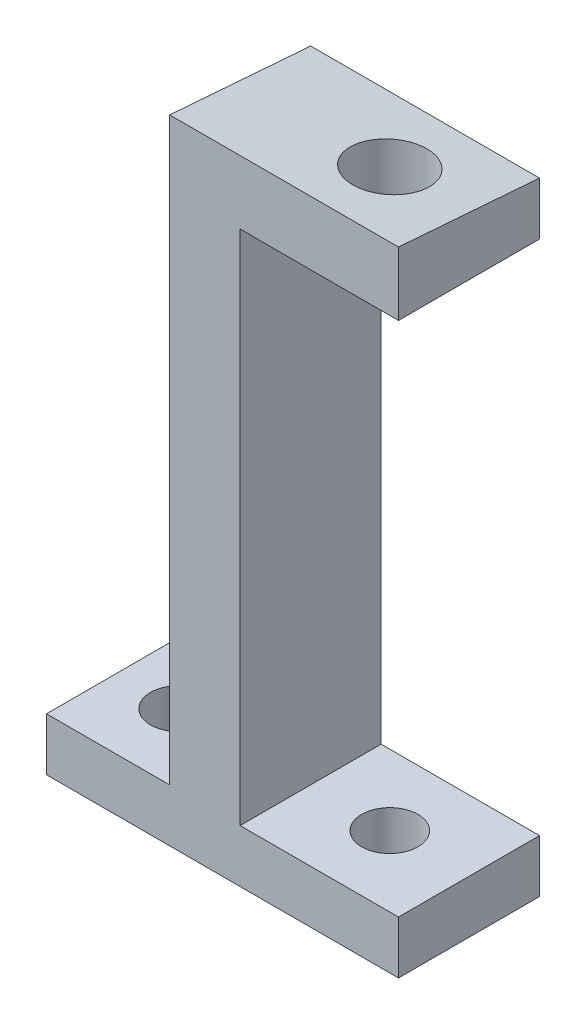
ISO-10303-21;
HEADER;
FILE_DESCRIPTION(('STEP AP214'),'2;1');
FILE_NAME('part.step','',(''),(''),'','','');
FILE_SCHEMA(('AUTOMOTIVE_DESIGN { 1 0 10303 214 1 1 1 1 }'));
ENDSEC;
DATA;
#1=APPLICATION_CONTEXT('core data for automotive mechanical design processes');
#2=APPLICATION_PROTOCOL_DEFINITION('international standard','automotive_design',2000,#1);
#3=PRODUCT_CONTEXT('',#1,'mechanical');
#4=PRODUCT('Part','Part','',(#3));
#5=PRODUCT_RELATED_PRODUCT_CATEGORY('part','',(#4));
#6=PRODUCT_DEFINITION_FORMATION('','',#4);
#7=PRODUCT_DEFINITION_CONTEXT('part definition',#1,'design');
#8=PRODUCT_DEFINITION('design','',#6,#7);
#9=PRODUCT_DEFINITION_SHAPE('','',#8);
#10=(LENGTH_UNIT() NAMED_UNIT(*) SI_UNIT(.MILLI.,.METRE.));
#11=(NAMED_UNIT(*) PLANE_ANGLE_UNIT() SI_UNIT($,.RADIAN.));
#12=(NAMED_UNIT(*) SI_UNIT($,.STERADIAN.) SOLID_ANGLE_UNIT());
#13=UNCERTAINTY_MEASURE_WITH_UNIT(LENGTH_MEASURE(1.E-05),#10,'distance_accuracy_value','');
#14=(GEOMETRIC_REPRESENTATION_CONTEXT(3) GLOBAL_UNCERTAINTY_ASSIGNED_CONTEXT((#13)) GLOBAL_UNIT_ASSIGNED_CONTEXT((#10,
#11,#12)) REPRESENTATION_CONTEXT('',''));
#15=CARTESIAN_POINT('',(0.,0.,0.));
#16=DIRECTION('',(0.,0.,1.));
#17=DIRECTION('',(1.,0.,0.));
#18=AXIS2_PLACEMENT_3D('',#15,#16,#17);
#19=CARTESIAN_POINT('',(-29.1166637722037,0.,-124.13391835524));
#20=DIRECTION('',(0.,0.,1.));
#21=DIRECTION('',(1.,0.,0.));
#22=AXIS2_PLACEMENT_3D('',#19,#20,#21);
#23=PLANE('',#22);
#24=DIRECTION('',(0.,-1.,0.));
#25=VECTOR('',#24,1.);
#26=CARTESIAN_POINT('',(-20.1166637722037,0.,-124.13391835524));
#27=LINE('',#26,#25);
#28=CARTESIAN_POINT('',(-20.1166637722038,76.6813694194692,-124.13391835524));
#29=VERTEX_POINT('',#28);
#30=CARTESIAN_POINT('',(-20.1166637722038,73.6813694194692,-124.13391835524));
#31=VERTEX_POINT('',#30);
#32=EDGE_CURVE('E190',#29,#31,#27,.T.);
#33=ORIENTED_EDGE('',*,*,#32,.T.);
#34=DIRECTION('',(1.,0.,0.));
#35=VECTOR('',#34,1.);
#36=CARTESIAN_POINT('',(-29.1166637722038,73.6813694194691,-124.13391835524));
#37=LINE('',#36,#35);
#38=CARTESIAN_POINT('',(-40.1166637722038,73.6813694194691,-124.13391835524));
#39=VERTEX_POINT('',#38);
#40=EDGE_CURVE('E12',#39,#31,#37,.T.);
#41=ORIENTED_EDGE('',*,*,#40,.F.);
#42=DIRECTION('',(0.,-1.,0.));
#43=VECTOR('',#42,1.);
#44=CARTESIAN_POINT('',(-40.1166637722037,0.,-124.13391835524));
#45=LINE('',#44,#43);
#46=CARTESIAN_POINT('',(-40.1166637722038,76.6813694194691,-124.13391835524));
#47=VERTEX_POINT('',#46);
#48=EDGE_CURVE('E256',#47,#39,#45,.T.);
#49=ORIENTED_EDGE('',*,*,#48,.F.);
#50=DIRECTION('',(1.,0.,0.));
#51=VECTOR('',#50,1.);
#52=CARTESIAN_POINT('',(-40.1166637722038,76.6813694194691,-124.13391835524));
#53=LINE('',#52,#51);
#54=CARTESIAN_POINT('',(-33.1166637722038,76.6813694194691,-124.13391835524));
#55=VERTEX_POINT('',#54);
#56=EDGE_CURVE('E248',#47,#55,#53,.T.);
#57=ORIENTED_EDGE('',*,*,#56,.T.);
#58=DIRECTION('',(0.,-1.,0.));
#59=VECTOR('',#58,1.);
#60=CARTESIAN_POINT('',(-33.1166637722037,0.,-124.13391835524));
#61=LINE('',#60,#59);
#62=CARTESIAN_POINT('',(-33.1166637722038,109.035971289038,-124.13391835524));
#63=VERTEX_POINT('',#62);
#64=EDGE_CURVE('E211',#63,#55,#61,.T.);
#65=ORIENTED_EDGE('',*,*,#64,.F.);
#66=DIRECTION('',(1.,0.,0.));
#67=VECTOR('',#66,1.);
#68=CARTESIAN_POINT('',(-33.1166637722038,109.035971289038,-124.13391835524));
#69=LINE('',#68,#67);
#70=CARTESIAN_POINT('',(-20.1166637722038,109.035971289038,-124.13391835524));
#71=VERTEX_POINT('',#70);
#72=EDGE_CURVE('E203',#63,#71,#69,.T.);
#73=ORIENTED_EDGE('',*,*,#72,.T.);
#74=DIRECTION('',(0.,-1.,0.));
#75=VECTOR('',#74,1.);
#76=CARTESIAN_POINT('',(-20.1166637722037,0.,-124.13391835524));
#77=LINE('',#76,#75);
#78=CARTESIAN_POINT('',(-20.1166637722038,106.035971289038,-124.13391835524));
#79=VERTEX_POINT('',#78);
#80=EDGE_CURVE('E237',#71,#79,#77,.T.);
#81=ORIENTED_EDGE('',*,*,#80,.T.);
#82=DIRECTION('',(1.,0.,0.));
#83=VECTOR('',#82,1.);
#84=CARTESIAN_POINT('',(-29.1166637722038,106.035971289038,-124.13391835524));
#85=LINE('',#84,#83);
#86=CARTESIAN_POINT('',(-29.1166637722038,106.035971289038,-124.13391835524));
#87=VERTEX_POINT('',#86);
#88=EDGE_CURVE('E223',#87,#79,#85,.T.);
#89=ORIENTED_EDGE('',*,*,#88,.F.);
#90=DIRECTION('',(0.,-1.,0.));
#91=VECTOR('',#90,1.);
#92=CARTESIAN_POINT('',(-29.1166637722037,0.,-124.13391835524));
#93=LINE('',#92,#91);
#94=CARTESIAN_POINT('',(-29.1166637722038,76.6813694194691,-124.13391835524));
#95=VERTEX_POINT('',#94);
#96=EDGE_CURVE('E220',#87,#95,#93,.T.);
#97=ORIENTED_EDGE('',*,*,#96,.T.);
#98=DIRECTION('',(1.,0.,0.));
#99=VECTOR('',#98,1.);
#100=CARTESIAN_POINT('',(-29.1166637722038,76.6813694194691,-124.13391835524));
#101=LINE('',#100,#99);
#102=EDGE_CURVE('E124',#95,#29,#101,.T.);
#103=ORIENTED_EDGE('',*,*,#102,.T.);
#104=EDGE_LOOP('',(#33,#41,#49,#57,#65,#73,#81,#89,#97,#103));
#105=FACE_BOUND('',#104,.T.);
#106=ADVANCED_FACE('F121',(#105),#23,.F.);
#107=CARTESIAN_POINT('',(-29.1166637722036,73.6813694194691,0.));
#108=DIRECTION('',(0.,1.,0.));
#109=DIRECTION('',(-1.,0.,0.));
#110=AXIS2_PLACEMENT_3D('',#107,#108,#109);
#111=PLANE('',#110);
#112=CARTESIAN_POINT('',(-24.6166637722038,73.6813694194691,-120.127472221893));
#113=DIRECTION('',(0.,1.,0.));
#114=DIRECTION('',(-1.,0.,0.));
#115=AXIS2_PLACEMENT_3D('',#112,#113,#114);
#116=CIRCLE('',#115,1.60000000000002);
#117=CARTESIAN_POINT('',(-26.2166637722038,73.6813694194691,-120.127472221893));
#118=VERTEX_POINT('',#117);
#119=EDGE_CURVE('E254',#118,#118,#116,.F.);
#120=ORIENTED_EDGE('',*,*,#119,.F.);
#121=EDGE_LOOP('',(#120));
#122=FACE_BOUND('',#121,.T.);
#123=CARTESIAN_POINT('',(-36.6166637722038,73.6813694194691,-120.127472221893));
#124=DIRECTION('',(0.,1.,0.));
#125=DIRECTION('',(-1.,0.,0.));
#126=AXIS2_PLACEMENT_3D('',#123,#124,#125);
#127=CIRCLE('',#126,1.60000000000034);
#128=CARTESIAN_POINT('',(-38.2166637722041,73.6813694194691,-120.127472221893));
#129=VERTEX_POINT('',#128);
#130=EDGE_CURVE('E266',#129,#129,#127,.F.);
#131=ORIENTED_EDGE('',*,*,#130,.F.);
#132=EDGE_LOOP('',(#131));
#133=FACE_BOUND('',#132,.T.);
#134=DIRECTION('',(0.,0.,1.));
#135=VECTOR('',#134,1.);
#136=CARTESIAN_POINT('',(-20.1166637722036,73.6813694194692,0.));
#137=LINE('',#136,#135);
#138=CARTESIAN_POINT('',(-20.1166637722037,73.6813694194692,-116.121026088545));
#139=VERTEX_POINT('',#138);
#140=EDGE_CURVE('E163',#31,#139,#137,.T.);
#141=ORIENTED_EDGE('',*,*,#140,.T.);
#142=DIRECTION('',(1.,0.,0.));
#143=VECTOR('',#142,1.);
#144=CARTESIAN_POINT('',(-29.1166637722037,73.6813694194691,-116.121026088545));
#145=LINE('',#144,#143);
#146=CARTESIAN_POINT('',(-40.1166637722038,73.6813694194691,-116.121026088545));
#147=VERTEX_POINT('',#146);
#148=EDGE_CURVE('E129',#147,#139,#145,.T.);
#149=ORIENTED_EDGE('',*,*,#148,.F.);
#150=DIRECTION('',(0.,0.,1.));
#151=VECTOR('',#150,1.);
#152=CARTESIAN_POINT('',(-40.1166637722036,73.6813694194691,0.));
#153=LINE('',#152,#151);
#154=EDGE_CURVE('E251',#39,#147,#153,.T.);
#155=ORIENTED_EDGE('',*,*,#154,.F.);
#156=ORIENTED_EDGE('',*,*,#40,.T.);
#157=EDGE_LOOP('',(#141,#149,#155,#156));
#158=FACE_BOUND('',#157,.T.);
#159=ADVANCED_FACE('F165',(#122,#133,#158),#111,.F.);
#160=CARTESIAN_POINT('',(-29.1166637722037,0.,-116.121026088545));
#161=DIRECTION('',(0.,0.,-1.));
#162=DIRECTION('',(-1.,0.,0.));
#163=AXIS2_PLACEMENT_3D('',#160,#161,#162);
#164=PLANE('',#163);
#165=DIRECTION('',(0.,1.,0.));
#166=VECTOR('',#165,1.);
#167=CARTESIAN_POINT('',(-20.1166637722037,0.,-116.121026088545));
#168=LINE('',#167,#166);
#169=CARTESIAN_POINT('',(-20.1166637722038,76.6813694194692,-116.121026088545));
#170=VERTEX_POINT('',#169);
#171=EDGE_CURVE('E175',#139,#170,#168,.T.);
#172=ORIENTED_EDGE('',*,*,#171,.T.);
#173=DIRECTION('',(1.,0.,0.));
#174=VECTOR('',#173,1.);
#175=CARTESIAN_POINT('',(-29.1166637722038,76.6813694194691,-116.121026088545));
#176=LINE('',#175,#174);
#177=CARTESIAN_POINT('',(-29.1166637722038,76.6813694194691,-116.121026088545));
#178=VERTEX_POINT('',#177);
#179=EDGE_CURVE('E184',#178,#170,#176,.T.);
#180=ORIENTED_EDGE('',*,*,#179,.F.);
#181=DIRECTION('',(0.,1.,0.));
#182=VECTOR('',#181,1.);
#183=CARTESIAN_POINT('',(-29.1166637722037,0.,-116.121026088545));
#184=LINE('',#183,#182);
#185=CARTESIAN_POINT('',(-29.1166637722038,106.035971289038,-116.121026088545));
#186=VERTEX_POINT('',#185);
#187=EDGE_CURVE('E146',#178,#186,#184,.T.);
#188=ORIENTED_EDGE('',*,*,#187,.T.);
#189=DIRECTION('',(1.,0.,0.));
#190=VECTOR('',#189,1.);
#191=CARTESIAN_POINT('',(-29.1166637722038,106.035971289038,-116.121026088545));
#192=LINE('',#191,#190);
#193=CARTESIAN_POINT('',(-20.1166637722038,106.035971289038,-116.121026088545));
#194=VERTEX_POINT('',#193);
#195=EDGE_CURVE('E229',#186,#194,#192,.T.);
#196=ORIENTED_EDGE('',*,*,#195,.T.);
#197=DIRECTION('',(0.,1.,0.));
#198=VECTOR('',#197,1.);
#199=CARTESIAN_POINT('',(-20.1166637722037,0.,-116.121026088545));
#200=LINE('',#199,#198);
#201=CARTESIAN_POINT('',(-20.1166637722038,109.651271916847,-116.121026088545));
#202=VERTEX_POINT('',#201);
#203=EDGE_CURVE('E242',#194,#202,#200,.T.);
#204=ORIENTED_EDGE('',*,*,#203,.T.);
#205=DIRECTION('',(1.,0.,0.));
#206=VECTOR('',#205,1.);
#207=CARTESIAN_POINT('',(-33.1166637722038,109.651271916847,-116.121026088545));
#208=LINE('',#207,#206);
#209=CARTESIAN_POINT('',(-33.1166637722038,109.651271916847,-116.121026088545));
#210=VERTEX_POINT('',#209);
#211=EDGE_CURVE('E200',#210,#202,#208,.T.);
#212=ORIENTED_EDGE('',*,*,#211,.F.);
#213=DIRECTION('',(0.,1.,0.));
#214=VECTOR('',#213,1.);
#215=CARTESIAN_POINT('',(-33.1166637722037,0.,-116.121026088545));
#216=LINE('',#215,#214);
#217=CARTESIAN_POINT('',(-33.1166637722038,76.6813694194691,-116.121026088545));
#218=VERTEX_POINT('',#217);
#219=EDGE_CURVE('E222',#218,#210,#216,.T.);
#220=ORIENTED_EDGE('',*,*,#219,.F.);
#221=DIRECTION('',(1.,0.,0.));
#222=VECTOR('',#221,1.);
#223=CARTESIAN_POINT('',(-40.1166637722038,76.6813694194691,-116.121026088545));
#224=LINE('',#223,#222);
#225=CARTESIAN_POINT('',(-40.1166637722038,76.6813694194691,-116.121026088545));
#226=VERTEX_POINT('',#225);
#227=EDGE_CURVE('E137',#226,#218,#224,.T.);
#228=ORIENTED_EDGE('',*,*,#227,.F.);
#229=DIRECTION('',(0.,1.,0.));
#230=VECTOR('',#229,1.);
#231=CARTESIAN_POINT('',(-40.1166637722037,0.,-116.121026088545));
#232=LINE('',#231,#230);
#233=EDGE_CURVE('E183',#147,#226,#232,.T.);
#234=ORIENTED_EDGE('',*,*,#233,.F.);
#235=ORIENTED_EDGE('',*,*,#148,.T.);
#236=EDGE_LOOP('',(#172,#180,#188,#196,#204,#212,#220,#228,#234,#235));
#237=FACE_BOUND('',#236,.T.);
#238=ADVANCED_FACE('F180',(#237),#164,.F.);
#239=CARTESIAN_POINT('',(-29.1166637722036,76.6813694194691,0.));
#240=DIRECTION('',(0.,1.,0.));
#241=DIRECTION('',(-1.,0.,0.));
#242=AXIS2_PLACEMENT_3D('',#239,#240,#241);
#243=PLANE('',#242);
#244=CARTESIAN_POINT('',(-24.6166637722038,76.6813694194691,-120.127472221893));
#245=DIRECTION('',(0.,1.,0.));
#246=DIRECTION('',(-1.,0.,0.));
#247=AXIS2_PLACEMENT_3D('',#244,#245,#246);
#248=CIRCLE('',#247,1.60000000000002);
#249=CARTESIAN_POINT('',(-26.2166637722038,76.6813694194691,-120.127472221893));
#250=VERTEX_POINT('',#249);
#251=EDGE_CURVE('E265',#250,#250,#248,.T.);
#252=ORIENTED_EDGE('',*,*,#251,.F.);
#253=EDGE_LOOP('',(#252));
#254=FACE_BOUND('',#253,.T.);
#255=DIRECTION('',(0.,0.,1.));
#256=VECTOR('',#255,1.);
#257=CARTESIAN_POINT('',(-20.1166637722036,76.6813694194692,0.));
#258=LINE('',#257,#256);
#259=EDGE_CURVE('E188',#29,#170,#258,.T.);
#260=ORIENTED_EDGE('',*,*,#259,.F.);
#261=ORIENTED_EDGE('',*,*,#102,.F.);
#262=DIRECTION('',(0.,0.,1.));
#263=VECTOR('',#262,1.);
#264=CARTESIAN_POINT('',(-29.1166637722036,76.6813694194691,0.));
#265=LINE('',#264,#263);
#266=EDGE_CURVE('E174',#95,#178,#265,.T.);
#267=ORIENTED_EDGE('',*,*,#266,.T.);
#268=ORIENTED_EDGE('',*,*,#179,.T.);
#269=EDGE_LOOP('',(#260,#261,#267,#268));
#270=FACE_BOUND('',#269,.T.);
#271=ADVANCED_FACE('F310',(#254,#270),#243,.T.);
#272=CARTESIAN_POINT('',(-20.1166637722035,0.,0.));
#273=DIRECTION('',(1.,0.,0.));
#274=DIRECTION('',(0.,0.,-1.));
#275=AXIS2_PLACEMENT_3D('',#272,#273,#274);
#276=PLANE('',#275);
#277=ORIENTED_EDGE('',*,*,#32,.F.);
#278=ORIENTED_EDGE('',*,*,#259,.T.);
#279=ORIENTED_EDGE('',*,*,#171,.F.);
#280=ORIENTED_EDGE('',*,*,#140,.F.);
#281=EDGE_LOOP('',(#277,#278,#279,#280));
#282=FACE_BOUND('',#281,.T.);
#283=ADVANCED_FACE('F186',(#282),#276,.T.);
#284=CARTESIAN_POINT('',(-29.1166637722035,0.,0.));
#285=DIRECTION('',(1.,0.,0.));
#286=DIRECTION('',(0.,0.,-1.));
#287=AXIS2_PLACEMENT_3D('',#284,#285,#286);
#288=PLANE('',#287);
#289=DIRECTION('',(0.,0.,-1.));
#290=VECTOR('',#289,1.);
#291=CARTESIAN_POINT('',(-29.1166637722037,106.035971289038,0.));
#292=LINE('',#291,#290);
#293=EDGE_CURVE('E232',#186,#87,#292,.T.);
#294=ORIENTED_EDGE('',*,*,#293,.F.);
#295=ORIENTED_EDGE('',*,*,#187,.F.);
#296=ORIENTED_EDGE('',*,*,#266,.F.);
#297=ORIENTED_EDGE('',*,*,#96,.F.);
#298=EDGE_LOOP('',(#294,#295,#296,#297));
#299=FACE_BOUND('',#298,.T.);
#300=ADVANCED_FACE('F309',(#299),#288,.T.);
#301=CARTESIAN_POINT('',(-33.1166637722037,117.873028528389,-9.05133203358516));
#302=DIRECTION('',(0.,-0.997064712375444,0.0765634334109578));
#303=DIRECTION('',(0.,-0.0765634334109578,-0.997064712375444));
#304=AXIS2_PLACEMENT_3D('',#301,#302,#303);
#305=PLANE('',#304);
#306=CARTESIAN_POINT('',(-24.6166637722035,109.343621602943,-120.127472221893));
#307=DIRECTION('',(0.,-0.997064712375444,0.0765634334109578));
#308=DIRECTION('',(0.,-0.0765634334109578,-0.997064712375444));
#309=AXIS2_PLACEMENT_3D('',#306,#307,#308);
#310=ELLIPSE('',#309,2.10618225069553,2.1);
#311=CARTESIAN_POINT('',(-24.6166637722035,109.18236505844,-122.227472221893));
#312=VERTEX_POINT('',#311);
#313=EDGE_CURVE('E269',#312,#312,#310,.F.);
#314=ORIENTED_EDGE('',*,*,#313,.F.);
#315=EDGE_LOOP('',(#314));
#316=FACE_BOUND('',#315,.T.);
#317=ORIENTED_EDGE('',*,*,#211,.T.);
#318=DIRECTION('',(0.,-0.0765634334109578,-0.997064712375443));
#319=VECTOR('',#318,1.);
#320=CARTESIAN_POINT('',(-20.1166637722037,117.873028528389,-9.05133203358518));
#321=LINE('',#320,#319);
#322=EDGE_CURVE('E235',#202,#71,#321,.T.);
#323=ORIENTED_EDGE('',*,*,#322,.T.);
#324=ORIENTED_EDGE('',*,*,#72,.F.);
#325=DIRECTION('',(0.,-0.0765634334109578,-0.997064712375444));
#326=VECTOR('',#325,1.);
#327=CARTESIAN_POINT('',(-33.1166637722037,117.873028528389,-9.05133203358516));
#328=LINE('',#327,#326);
#329=EDGE_CURVE('E217',#210,#63,#328,.T.);
#330=ORIENTED_EDGE('',*,*,#329,.F.);
#331=EDGE_LOOP('',(#317,#323,#324,#330));
#332=FACE_BOUND('',#331,.T.);
#333=ADVANCED_FACE('F331',(#316,#332),#305,.F.);
#334=CARTESIAN_POINT('',(-33.1166637722035,0.,0.));
#335=DIRECTION('',(1.,0.,0.));
#336=DIRECTION('',(0.,0.,-1.));
#337=AXIS2_PLACEMENT_3D('',#334,#335,#336);
#338=PLANE('',#337);
#339=ORIENTED_EDGE('',*,*,#64,.T.);
#340=DIRECTION('',(0.,0.,1.));
#341=VECTOR('',#340,1.);
#342=CARTESIAN_POINT('',(-33.1166637722036,76.6813694194691,0.));
#343=LINE('',#342,#341);
#344=EDGE_CURVE('E252',#55,#218,#343,.T.);
#345=ORIENTED_EDGE('',*,*,#344,.T.);
#346=ORIENTED_EDGE('',*,*,#219,.T.);
#347=ORIENTED_EDGE('',*,*,#329,.T.);
#348=EDGE_LOOP('',(#339,#345,#346,#347));
#349=FACE_BOUND('',#348,.T.);
#350=ADVANCED_FACE('F287',(#349),#338,.F.);
#351=CARTESIAN_POINT('',(-29.1166637722037,106.035971289038,0.));
#352=DIRECTION('',(0.,-1.,0.));
#353=DIRECTION('',(1.,0.,0.));
#354=AXIS2_PLACEMENT_3D('',#351,#352,#353);
#355=PLANE('',#354);
#356=CARTESIAN_POINT('',(-24.6166637722035,106.035971289038,-120.127472221893));
#357=DIRECTION('',(0.,-1.,0.));
#358=DIRECTION('',(1.,0.,0.));
#359=AXIS2_PLACEMENT_3D('',#356,#357,#358);
#360=CIRCLE('',#359,2.1);
#361=CARTESIAN_POINT('',(-22.5166637722035,106.035971289038,-120.127472221893));
#362=VERTEX_POINT('',#361);
#363=EDGE_CURVE('E276',#362,#362,#360,.T.);
#364=ORIENTED_EDGE('',*,*,#363,.F.);
#365=EDGE_LOOP('',(#364));
#366=FACE_BOUND('',#365,.T.);
#367=DIRECTION('',(0.,0.,-1.));
#368=VECTOR('',#367,1.);
#369=CARTESIAN_POINT('',(-20.1166637722037,106.035971289038,0.));
#370=LINE('',#369,#368);
#371=EDGE_CURVE('E239',#194,#79,#370,.T.);
#372=ORIENTED_EDGE('',*,*,#371,.F.);
#373=ORIENTED_EDGE('',*,*,#195,.F.);
#374=ORIENTED_EDGE('',*,*,#293,.T.);
#375=ORIENTED_EDGE('',*,*,#88,.T.);
#376=EDGE_LOOP('',(#372,#373,#374,#375));
#377=FACE_BOUND('',#376,.T.);
#378=ADVANCED_FACE('F283',(#366,#377),#355,.T.);
#379=CARTESIAN_POINT('',(-20.1166637722035,0.,0.));
#380=DIRECTION('',(1.,0.,0.));
#381=DIRECTION('',(0.,0.,-1.));
#382=AXIS2_PLACEMENT_3D('',#379,#380,#381);
#383=PLANE('',#382);
#384=ORIENTED_EDGE('',*,*,#203,.F.);
#385=ORIENTED_EDGE('',*,*,#371,.T.);
#386=ORIENTED_EDGE('',*,*,#80,.F.);
#387=ORIENTED_EDGE('',*,*,#322,.F.);
#388=EDGE_LOOP('',(#384,#385,#386,#387));
#389=FACE_BOUND('',#388,.T.);
#390=ADVANCED_FACE('F286',(#389),#383,.T.);
#391=CARTESIAN_POINT('',(-40.1166637722036,76.6813694194691,0.));
#392=DIRECTION('',(0.,1.,0.));
#393=DIRECTION('',(-1.,0.,0.));
#394=AXIS2_PLACEMENT_3D('',#391,#392,#393);
#395=PLANE('',#394);
#396=CARTESIAN_POINT('',(-36.6166637722038,76.6813694194691,-120.127472221893));
#397=DIRECTION('',(0.,1.,0.));
#398=DIRECTION('',(-1.,0.,0.));
#399=AXIS2_PLACEMENT_3D('',#396,#397,#398);
#400=CIRCLE('',#399,1.60000000000034);
#401=CARTESIAN_POINT('',(-38.2166637722041,76.6813694194691,-120.127472221893));
#402=VERTEX_POINT('',#401);
#403=EDGE_CURVE('E262',#402,#402,#400,.T.);
#404=ORIENTED_EDGE('',*,*,#403,.F.);
#405=EDGE_LOOP('',(#404));
#406=FACE_BOUND('',#405,.T.);
#407=ORIENTED_EDGE('',*,*,#344,.F.);
#408=ORIENTED_EDGE('',*,*,#56,.F.);
#409=DIRECTION('',(0.,0.,1.));
#410=VECTOR('',#409,1.);
#411=CARTESIAN_POINT('',(-40.1166637722036,76.6813694194691,0.));
#412=LINE('',#411,#410);
#413=EDGE_CURVE('E259',#47,#226,#412,.T.);
#414=ORIENTED_EDGE('',*,*,#413,.T.);
#415=ORIENTED_EDGE('',*,*,#227,.T.);
#416=EDGE_LOOP('',(#407,#408,#414,#415));
#417=FACE_BOUND('',#416,.T.);
#418=ADVANCED_FACE('F341',(#406,#417),#395,.T.);
#419=CARTESIAN_POINT('',(-40.1166637722035,0.,0.));
#420=DIRECTION('',(1.,0.,0.));
#421=DIRECTION('',(0.,0.,-1.));
#422=AXIS2_PLACEMENT_3D('',#419,#420,#421);
#423=PLANE('',#422);
#424=ORIENTED_EDGE('',*,*,#233,.T.);
#425=ORIENTED_EDGE('',*,*,#413,.F.);
#426=ORIENTED_EDGE('',*,*,#48,.T.);
#427=ORIENTED_EDGE('',*,*,#154,.T.);
#428=EDGE_LOOP('',(#424,#425,#426,#427));
#429=FACE_BOUND('',#428,.T.);
#430=ADVANCED_FACE('F344',(#429),#423,.F.);
#431=CARTESIAN_POINT('',(-36.6166637722038,73.6803694194691,-120.127472221893));
#432=DIRECTION('',(0.,1.,0.));
#433=DIRECTION('',(-1.,0.,0.));
#434=AXIS2_PLACEMENT_3D('',#431,#432,#433);
#435=CYLINDRICAL_SURFACE('',#434,1.60000000000034);
#436=ORIENTED_EDGE('',*,*,#403,.T.);
#437=EDGE_LOOP('',(#436));
#438=FACE_BOUND('',#437,.T.);
#439=ORIENTED_EDGE('',*,*,#130,.T.);
#440=EDGE_LOOP('',(#439));
#441=FACE_BOUND('',#440,.T.);
#442=ADVANCED_FACE('F348',(#438,#441),#435,.F.);
#443=CARTESIAN_POINT('',(-24.6166637722038,73.6803694194691,-120.127472221893));
#444=DIRECTION('',(0.,1.,0.));
#445=DIRECTION('',(-1.,0.,0.));
#446=AXIS2_PLACEMENT_3D('',#443,#444,#445);
#447=CYLINDRICAL_SURFACE('',#446,1.60000000000002);
#448=ORIENTED_EDGE('',*,*,#251,.T.);
#449=EDGE_LOOP('',(#448));
#450=FACE_BOUND('',#449,.T.);
#451=ORIENTED_EDGE('',*,*,#119,.T.);
#452=EDGE_LOOP('',(#451));
#453=FACE_BOUND('',#452,.T.);
#454=ADVANCED_FACE('F352',(#450,#453),#447,.F.);
#455=CARTESIAN_POINT('',(-24.6166637722035,109.652271916847,-120.127472221893));
#456=DIRECTION('',(0.,-1.,0.));
#457=DIRECTION('',(1.,0.,0.));
#458=AXIS2_PLACEMENT_3D('',#455,#456,#457);
#459=CYLINDRICAL_SURFACE('',#458,2.1);
#460=ORIENTED_EDGE('',*,*,#363,.T.);
#461=EDGE_LOOP('',(#460));
#462=FACE_BOUND('',#461,.T.);
#463=ORIENTED_EDGE('',*,*,#313,.T.);
#464=EDGE_LOOP('',(#463));
#465=FACE_BOUND('',#464,.T.);
#466=ADVANCED_FACE('F280',(#462,#465),#459,.F.);
#467=CLOSED_SHELL('',(#106,#159,#238,#271,#283,#300,#333,#350,#378,#390,#418,#430,#442,#454,#466));
#468=MANIFOLD_SOLID_BREP('B2',#467);
#469=ADVANCED_BREP_SHAPE_REPRESENTATION('',(#18,#468),#14);
#470=SHAPE_DEFINITION_REPRESENTATION(#9,#469);
ENDSEC;
END-ISO-10303-21;
